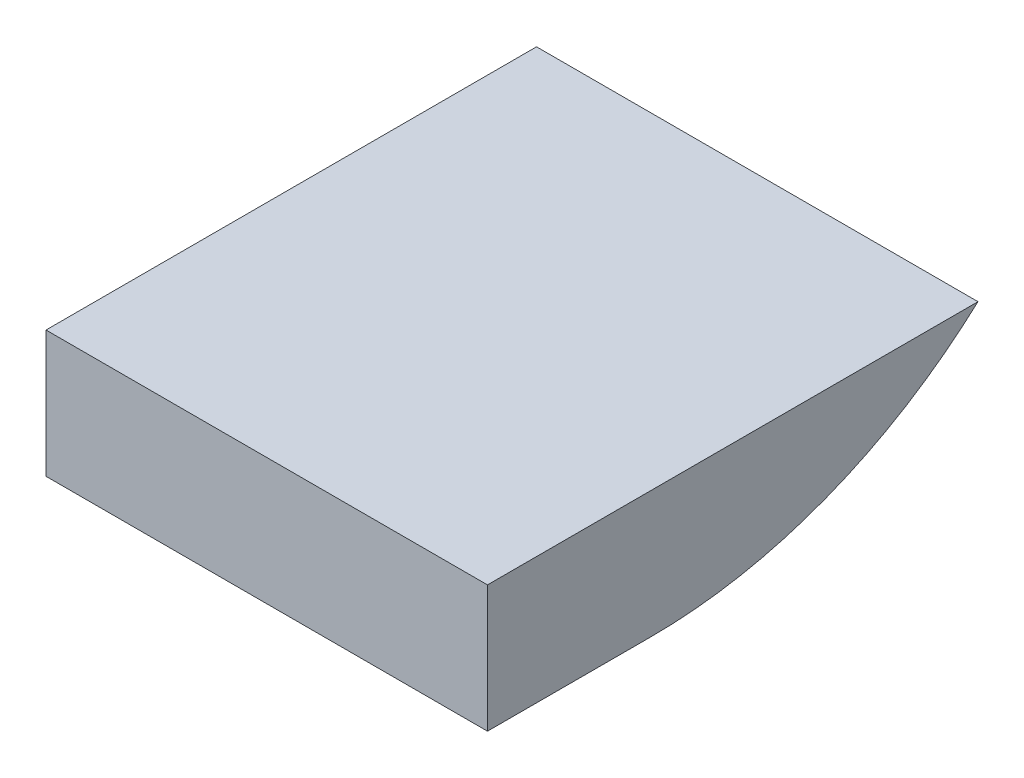
ISO-10303-21;
HEADER;
FILE_DESCRIPTION(('STEP AP214'),'2;1');
FILE_NAME('part.step','',(''),(''),'','','');
FILE_SCHEMA(('AUTOMOTIVE_DESIGN { 1 0 10303 214 1 1 1 1 }'));
ENDSEC;
DATA;
#1=APPLICATION_CONTEXT('core data for automotive mechanical design processes');
#2=APPLICATION_PROTOCOL_DEFINITION('international standard','automotive_design',2000,#1);
#3=PRODUCT_CONTEXT('',#1,'mechanical');
#4=PRODUCT('Part','Part','',(#3));
#5=PRODUCT_RELATED_PRODUCT_CATEGORY('part','',(#4));
#6=PRODUCT_DEFINITION_FORMATION('','',#4);
#7=PRODUCT_DEFINITION_CONTEXT('part definition',#1,'design');
#8=PRODUCT_DEFINITION('design','',#6,#7);
#9=PRODUCT_DEFINITION_SHAPE('','',#8);
#10=(LENGTH_UNIT() NAMED_UNIT(*) SI_UNIT(.MILLI.,.METRE.));
#11=(NAMED_UNIT(*) PLANE_ANGLE_UNIT() SI_UNIT($,.RADIAN.));
#12=(NAMED_UNIT(*) SI_UNIT($,.STERADIAN.) SOLID_ANGLE_UNIT());
#13=UNCERTAINTY_MEASURE_WITH_UNIT(LENGTH_MEASURE(1.E-05),#10,'distance_accuracy_value','');
#14=(GEOMETRIC_REPRESENTATION_CONTEXT(3) GLOBAL_UNCERTAINTY_ASSIGNED_CONTEXT((#13)) GLOBAL_UNIT_ASSIGNED_CONTEXT((#10,
#11,#12)) REPRESENTATION_CONTEXT('',''));
#15=CARTESIAN_POINT('',(0.,0.,0.));
#16=DIRECTION('',(0.,0.,1.));
#17=DIRECTION('',(1.,0.,0.));
#18=AXIS2_PLACEMENT_3D('',#15,#16,#17);
#19=CARTESIAN_POINT('',(10.8,-1.55,0.));
#20=DIRECTION('',(0.,1.,0.));
#21=DIRECTION('',(0.,0.,1.));
#22=AXIS2_PLACEMENT_3D('',#19,#20,#21);
#23=PLANE('',#22);
#24=DIRECTION('',(0.,0.,-1.));
#25=VECTOR('',#24,1.);
#26=CARTESIAN_POINT('',(0.,-1.55,0.));
#27=LINE('',#26,#25);
#28=CARTESIAN_POINT('',(0.,-1.55,2.));
#29=VERTEX_POINT('',#28);
#30=CARTESIAN_POINT('',(0.,-1.55,-2.));
#31=VERTEX_POINT('',#30);
#32=EDGE_CURVE('E99',#29,#31,#27,.T.);
#33=ORIENTED_EDGE('',*,*,#32,.T.);
#34=DIRECTION('',(-1.,0.,0.));
#35=VECTOR('',#34,1.);
#36=CARTESIAN_POINT('',(10.8,-1.55,-2.));
#37=LINE('',#36,#35);
#38=CARTESIAN_POINT('',(10.8,-1.55,-2.));
#39=VERTEX_POINT('',#38);
#40=EDGE_CURVE('E11',#39,#31,#37,.T.);
#41=ORIENTED_EDGE('',*,*,#40,.F.);
#42=DIRECTION('',(0.,0.,-1.));
#43=VECTOR('',#42,1.);
#44=CARTESIAN_POINT('',(10.8,-1.55,0.));
#45=LINE('',#44,#43);
#46=CARTESIAN_POINT('',(10.8,-1.55,2.));
#47=VERTEX_POINT('',#46);
#48=EDGE_CURVE('E84',#47,#39,#45,.T.);
#49=ORIENTED_EDGE('',*,*,#48,.F.);
#50=DIRECTION('',(-1.,0.,0.));
#51=VECTOR('',#50,1.);
#52=CARTESIAN_POINT('',(10.8,-1.55,2.));
#53=LINE('',#52,#51);
#54=EDGE_CURVE('E95',#47,#29,#53,.T.);
#55=ORIENTED_EDGE('',*,*,#54,.T.);
#56=EDGE_LOOP('',(#33,#41,#49,#55));
#57=FACE_BOUND('',#56,.T.);
#58=ADVANCED_FACE('F37',(#57),#23,.F.);
#59=CARTESIAN_POINT('',(10.8,10.3225806451613,-2.));
#60=DIRECTION('',(-1.,0.,0.));
#61=DIRECTION('',(0.,0.,1.));
#62=AXIS2_PLACEMENT_3D('',#59,#60,#61);
#63=CYLINDRICAL_SURFACE('',#62,11.8725806451613);
#64=CARTESIAN_POINT('',(0.,10.3225806451613,-2.));
#65=DIRECTION('',(1.,0.,0.));
#66=DIRECTION('',(0.,0.,-1.));
#67=AXIS2_PLACEMENT_3D('',#64,#65,#66);
#68=CIRCLE('',#67,11.8725806451613);
#69=CARTESIAN_POINT('',(0.,1.55,-10.));
#70=VERTEX_POINT('',#69);
#71=EDGE_CURVE('E89',#31,#70,#68,.T.);
#72=ORIENTED_EDGE('',*,*,#71,.T.);
#73=DIRECTION('',(-1.,0.,0.));
#74=VECTOR('',#73,1.);
#75=CARTESIAN_POINT('',(10.8,1.55,-10.));
#76=LINE('',#75,#74);
#77=CARTESIAN_POINT('',(10.8,1.55,-10.));
#78=VERTEX_POINT('',#77);
#79=EDGE_CURVE('E45',#78,#70,#76,.T.);
#80=ORIENTED_EDGE('',*,*,#79,.F.);
#81=CARTESIAN_POINT('',(10.8,10.3225806451613,-2.));
#82=DIRECTION('',(1.,0.,0.));
#83=DIRECTION('',(0.,0.,-1.));
#84=AXIS2_PLACEMENT_3D('',#81,#82,#83);
#85=CIRCLE('',#84,11.8725806451613);
#86=EDGE_CURVE('E79',#39,#78,#85,.T.);
#87=ORIENTED_EDGE('',*,*,#86,.F.);
#88=ORIENTED_EDGE('',*,*,#40,.T.);
#89=EDGE_LOOP('',(#72,#80,#87,#88));
#90=FACE_BOUND('',#89,.T.);
#91=ADVANCED_FACE('F88',(#90),#63,.T.);
#92=CARTESIAN_POINT('',(10.8,1.55,0.));
#93=DIRECTION('',(0.,1.,0.));
#94=DIRECTION('',(0.,0.,1.));
#95=AXIS2_PLACEMENT_3D('',#92,#93,#94);
#96=PLANE('',#95);
#97=DIRECTION('',(0.,0.,-1.));
#98=VECTOR('',#97,1.);
#99=CARTESIAN_POINT('',(0.,1.55,0.));
#100=LINE('',#99,#98);
#101=CARTESIAN_POINT('',(0.,1.55,2.));
#102=VERTEX_POINT('',#101);
#103=EDGE_CURVE('E103',#102,#70,#100,.T.);
#104=ORIENTED_EDGE('',*,*,#103,.F.);
#105=DIRECTION('',(-1.,0.,0.));
#106=VECTOR('',#105,1.);
#107=CARTESIAN_POINT('',(10.8,1.55,2.));
#108=LINE('',#107,#106);
#109=CARTESIAN_POINT('',(10.8,1.55,2.));
#110=VERTEX_POINT('',#109);
#111=EDGE_CURVE('E69',#110,#102,#108,.T.);
#112=ORIENTED_EDGE('',*,*,#111,.F.);
#113=DIRECTION('',(0.,0.,-1.));
#114=VECTOR('',#113,1.);
#115=CARTESIAN_POINT('',(10.8,1.55,0.));
#116=LINE('',#115,#114);
#117=EDGE_CURVE('E82',#110,#78,#116,.T.);
#118=ORIENTED_EDGE('',*,*,#117,.T.);
#119=ORIENTED_EDGE('',*,*,#79,.T.);
#120=EDGE_LOOP('',(#104,#112,#118,#119));
#121=FACE_BOUND('',#120,.T.);
#122=ADVANCED_FACE('F93',(#121),#96,.T.);
#123=CARTESIAN_POINT('',(10.8,0.,2.));
#124=DIRECTION('',(0.,0.,-1.));
#125=DIRECTION('',(-1.,0.,0.));
#126=AXIS2_PLACEMENT_3D('',#123,#124,#125);
#127=PLANE('',#126);
#128=DIRECTION('',(0.,-1.,0.));
#129=VECTOR('',#128,1.);
#130=CARTESIAN_POINT('',(0.,0.,2.));
#131=LINE('',#130,#129);
#132=EDGE_CURVE('E72',#102,#29,#131,.T.);
#133=ORIENTED_EDGE('',*,*,#132,.T.);
#134=ORIENTED_EDGE('',*,*,#54,.F.);
#135=DIRECTION('',(0.,-1.,0.));
#136=VECTOR('',#135,1.);
#137=CARTESIAN_POINT('',(10.8,0.,2.));
#138=LINE('',#137,#136);
#139=EDGE_CURVE('E53',#110,#47,#138,.T.);
#140=ORIENTED_EDGE('',*,*,#139,.F.);
#141=ORIENTED_EDGE('',*,*,#111,.T.);
#142=EDGE_LOOP('',(#133,#134,#140,#141));
#143=FACE_BOUND('',#142,.T.);
#144=ADVANCED_FACE('F116',(#143),#127,.F.);
#145=CARTESIAN_POINT('',(10.8,0.,0.));
#146=DIRECTION('',(1.,0.,0.));
#147=DIRECTION('',(0.,0.,-1.));
#148=AXIS2_PLACEMENT_3D('',#145,#146,#147);
#149=PLANE('',#148);
#150=ORIENTED_EDGE('',*,*,#48,.T.);
#151=ORIENTED_EDGE('',*,*,#86,.T.);
#152=ORIENTED_EDGE('',*,*,#117,.F.);
#153=ORIENTED_EDGE('',*,*,#139,.T.);
#154=EDGE_LOOP('',(#150,#151,#152,#153));
#155=FACE_BOUND('',#154,.T.);
#156=ADVANCED_FACE('F80',(#155),#149,.T.);
#157=CARTESIAN_POINT('',(0.,0.,0.));
#158=DIRECTION('',(1.,0.,0.));
#159=DIRECTION('',(0.,0.,-1.));
#160=AXIS2_PLACEMENT_3D('',#157,#158,#159);
#161=PLANE('',#160);
#162=ORIENTED_EDGE('',*,*,#32,.F.);
#163=ORIENTED_EDGE('',*,*,#132,.F.);
#164=ORIENTED_EDGE('',*,*,#103,.T.);
#165=ORIENTED_EDGE('',*,*,#71,.F.);
#166=EDGE_LOOP('',(#162,#163,#164,#165));
#167=FACE_BOUND('',#166,.T.);
#168=ADVANCED_FACE('F110',(#167),#161,.F.);
#169=CLOSED_SHELL('',(#58,#91,#122,#144,#156,#168));
#170=MANIFOLD_SOLID_BREP('B2',#169);
#171=ADVANCED_BREP_SHAPE_REPRESENTATION('',(#18,#170),#14);
#172=SHAPE_DEFINITION_REPRESENTATION(#9,#171);
ENDSEC;
END-ISO-10303-21;
